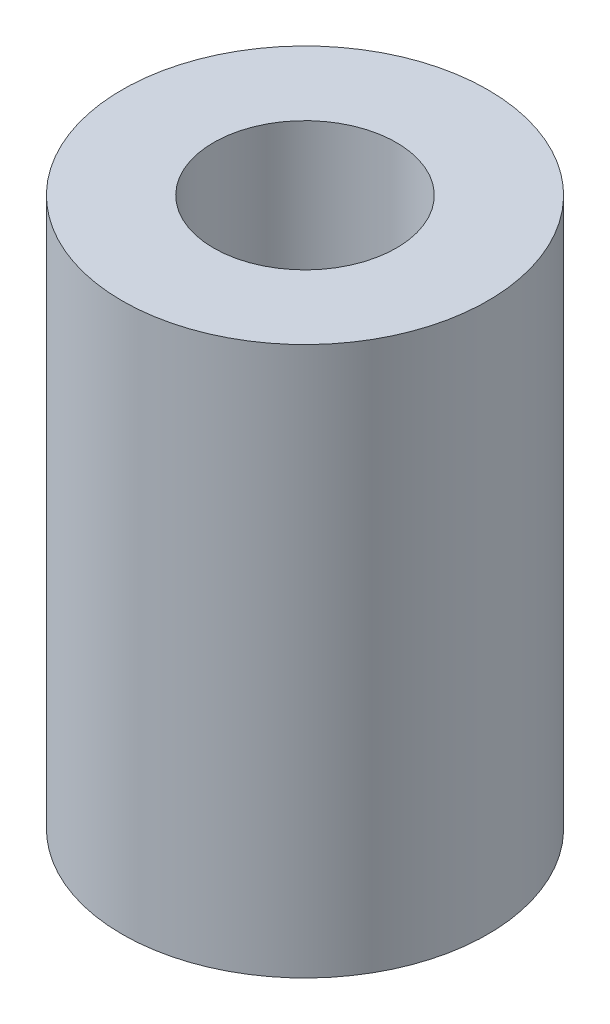
ISO-10303-21;
HEADER;
FILE_DESCRIPTION(('STEP AP214'),'2;1');
FILE_NAME('part.step','',(''),(''),'','','');
FILE_SCHEMA(('AUTOMOTIVE_DESIGN { 1 0 10303 214 1 1 1 1 }'));
ENDSEC;
DATA;
#1=APPLICATION_CONTEXT('core data for automotive mechanical design processes');
#2=APPLICATION_PROTOCOL_DEFINITION('international standard','automotive_design',2000,#1);
#3=PRODUCT_CONTEXT('',#1,'mechanical');
#4=PRODUCT('Part','Part','',(#3));
#5=PRODUCT_RELATED_PRODUCT_CATEGORY('part','',(#4));
#6=PRODUCT_DEFINITION_FORMATION('','',#4);
#7=PRODUCT_DEFINITION_CONTEXT('part definition',#1,'design');
#8=PRODUCT_DEFINITION('design','',#6,#7);
#9=PRODUCT_DEFINITION_SHAPE('','',#8);
#10=(LENGTH_UNIT() NAMED_UNIT(*) SI_UNIT(.MILLI.,.METRE.));
#11=(NAMED_UNIT(*) PLANE_ANGLE_UNIT() SI_UNIT($,.RADIAN.));
#12=(NAMED_UNIT(*) SI_UNIT($,.STERADIAN.) SOLID_ANGLE_UNIT());
#13=UNCERTAINTY_MEASURE_WITH_UNIT(LENGTH_MEASURE(1.E-05),#10,'distance_accuracy_value','');
#14=(GEOMETRIC_REPRESENTATION_CONTEXT(3) GLOBAL_UNCERTAINTY_ASSIGNED_CONTEXT((#13)) GLOBAL_UNIT_ASSIGNED_CONTEXT((#10,
#11,#12)) REPRESENTATION_CONTEXT('',''));
#15=CARTESIAN_POINT('',(0.,0.,0.));
#16=DIRECTION('',(0.,0.,1.));
#17=DIRECTION('',(1.,0.,0.));
#18=AXIS2_PLACEMENT_3D('',#15,#16,#17);
#19=CARTESIAN_POINT('',(0.,9.,0.));
#20=DIRECTION('',(0.,-1.,0.));
#21=DIRECTION('',(0.,0.,-1.));
#22=AXIS2_PLACEMENT_3D('',#19,#20,#21);
#23=CYLINDRICAL_SURFACE('',#22,3.);
#24=CARTESIAN_POINT('',(0.,9.,0.));
#25=DIRECTION('',(0.,1.,0.));
#26=DIRECTION('',(0.,0.,1.));
#27=AXIS2_PLACEMENT_3D('',#24,#25,#26);
#28=CIRCLE('',#27,3.);
#29=CARTESIAN_POINT('',(0.,9.,3.));
#30=VERTEX_POINT('',#29);
#31=EDGE_CURVE('E10',#30,#30,#28,.T.);
#32=ORIENTED_EDGE('',*,*,#31,.F.);
#33=EDGE_LOOP('',(#32));
#34=FACE_BOUND('',#33,.T.);
#35=CARTESIAN_POINT('',(0.,0.,0.));
#36=DIRECTION('',(0.,1.,0.));
#37=DIRECTION('',(0.,0.,1.));
#38=AXIS2_PLACEMENT_3D('',#35,#36,#37);
#39=CIRCLE('',#38,3.);
#40=CARTESIAN_POINT('',(0.,0.,3.));
#41=VERTEX_POINT('',#40);
#42=EDGE_CURVE('E33',#41,#41,#39,.T.);
#43=ORIENTED_EDGE('',*,*,#42,.T.);
#44=EDGE_LOOP('',(#43));
#45=FACE_BOUND('',#44,.T.);
#46=ADVANCED_FACE('F30',(#34,#45),#23,.T.);
#47=CARTESIAN_POINT('',(0.,9.,0.));
#48=DIRECTION('',(0.,1.,0.));
#49=DIRECTION('',(0.,0.,1.));
#50=AXIS2_PLACEMENT_3D('',#47,#48,#49);
#51=PLANE('',#50);
#52=CARTESIAN_POINT('',(0.,9.,0.));
#53=DIRECTION('',(0.,1.,0.));
#54=DIRECTION('',(0.,0.,1.));
#55=AXIS2_PLACEMENT_3D('',#52,#53,#54);
#56=CIRCLE('',#55,1.5);
#57=CARTESIAN_POINT('',(0.,9.,1.5));
#58=VERTEX_POINT('',#57);
#59=EDGE_CURVE('E42',#58,#58,#56,.T.);
#60=ORIENTED_EDGE('',*,*,#59,.F.);
#61=EDGE_LOOP('',(#60));
#62=FACE_BOUND('',#61,.T.);
#63=ORIENTED_EDGE('',*,*,#31,.T.);
#64=EDGE_LOOP('',(#63));
#65=FACE_BOUND('',#64,.T.);
#66=ADVANCED_FACE('F57',(#62,#65),#51,.T.);
#67=CARTESIAN_POINT('',(0.,0.,0.));
#68=DIRECTION('',(0.,1.,0.));
#69=DIRECTION('',(0.,0.,1.));
#70=AXIS2_PLACEMENT_3D('',#67,#68,#69);
#71=PLANE('',#70);
#72=CARTESIAN_POINT('',(0.,0.,0.));
#73=DIRECTION('',(0.,1.,0.));
#74=DIRECTION('',(0.,0.,1.));
#75=AXIS2_PLACEMENT_3D('',#72,#73,#74);
#76=CIRCLE('',#75,1.5);
#77=CARTESIAN_POINT('',(0.,0.,1.5));
#78=VERTEX_POINT('',#77);
#79=EDGE_CURVE('E40',#78,#78,#76,.T.);
#80=ORIENTED_EDGE('',*,*,#79,.T.);
#81=EDGE_LOOP('',(#80));
#82=FACE_BOUND('',#81,.T.);
#83=ORIENTED_EDGE('',*,*,#42,.F.);
#84=EDGE_LOOP('',(#83));
#85=FACE_BOUND('',#84,.T.);
#86=ADVANCED_FACE('F48',(#82,#85),#71,.F.);
#87=CARTESIAN_POINT('',(0.,0.,0.));
#88=DIRECTION('',(0.,1.,0.));
#89=DIRECTION('',(0.,0.,1.));
#90=AXIS2_PLACEMENT_3D('',#87,#88,#89);
#91=CYLINDRICAL_SURFACE('',#90,1.5);
#92=ORIENTED_EDGE('',*,*,#79,.F.);
#93=EDGE_LOOP('',(#92));
#94=FACE_BOUND('',#93,.T.);
#95=ORIENTED_EDGE('',*,*,#59,.T.);
#96=EDGE_LOOP('',(#95));
#97=FACE_BOUND('',#96,.T.);
#98=ADVANCED_FACE('F51',(#94,#97),#91,.F.);
#99=CLOSED_SHELL('',(#46,#66,#86,#98));
#100=MANIFOLD_SOLID_BREP('B2',#99);
#101=ADVANCED_BREP_SHAPE_REPRESENTATION('',(#18,#100),#14);
#102=SHAPE_DEFINITION_REPRESENTATION(#9,#101);
ENDSEC;
END-ISO-10303-21;
